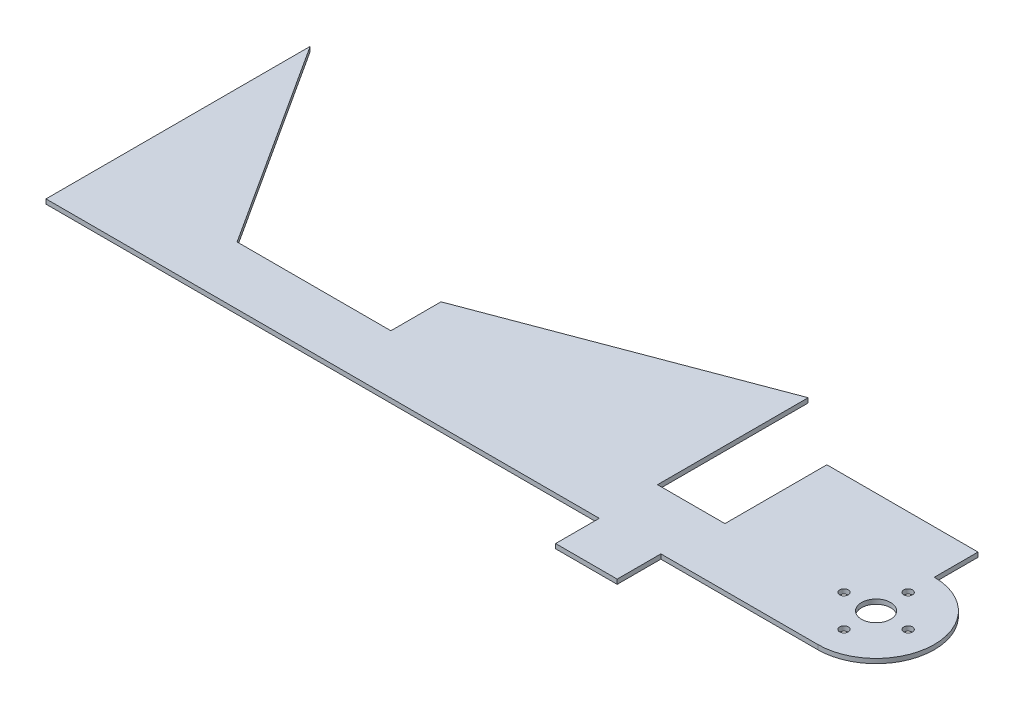
ISO-10303-21;
HEADER;
FILE_DESCRIPTION(('STEP AP214'),'2;1');
FILE_NAME('part.step','',(''),(''),'','','');
FILE_SCHEMA(('AUTOMOTIVE_DESIGN { 1 0 10303 214 1 1 1 1 }'));
ENDSEC;
DATA;
#1=APPLICATION_CONTEXT('core data for automotive mechanical design processes');
#2=APPLICATION_PROTOCOL_DEFINITION('international standard','automotive_design',2000,#1);
#3=PRODUCT_CONTEXT('',#1,'mechanical');
#4=PRODUCT('Part','Part','',(#3));
#5=PRODUCT_RELATED_PRODUCT_CATEGORY('part','',(#4));
#6=PRODUCT_DEFINITION_FORMATION('','',#4);
#7=PRODUCT_DEFINITION_CONTEXT('part definition',#1,'design');
#8=PRODUCT_DEFINITION('design','',#6,#7);
#9=PRODUCT_DEFINITION_SHAPE('','',#8);
#10=(LENGTH_UNIT() NAMED_UNIT(*) SI_UNIT(.MILLI.,.METRE.));
#11=(NAMED_UNIT(*) PLANE_ANGLE_UNIT() SI_UNIT($,.RADIAN.));
#12=(NAMED_UNIT(*) SI_UNIT($,.STERADIAN.) SOLID_ANGLE_UNIT());
#13=UNCERTAINTY_MEASURE_WITH_UNIT(LENGTH_MEASURE(1.E-05),#10,'distance_accuracy_value','');
#14=(GEOMETRIC_REPRESENTATION_CONTEXT(3) GLOBAL_UNCERTAINTY_ASSIGNED_CONTEXT((#13)) GLOBAL_UNIT_ASSIGNED_CONTEXT((#10,
#11,#12)) REPRESENTATION_CONTEXT('',''));
#15=CARTESIAN_POINT('',(0.,0.,0.));
#16=DIRECTION('',(0.,0.,1.));
#17=DIRECTION('',(1.,0.,0.));
#18=AXIS2_PLACEMENT_3D('',#15,#16,#17);
#19=CARTESIAN_POINT('',(0.,1.000000032,47.7604589923772));
#20=DIRECTION('',(0.,0.,-1.));
#21=DIRECTION('',(-1.,0.,0.));
#22=AXIS2_PLACEMENT_3D('',#19,#20,#21);
#23=PLANE('',#22);
#24=DIRECTION('',(0.,1.,0.));
#25=VECTOR('',#24,1.);
#26=CARTESIAN_POINT('',(73.7550000640245,0.,47.7604589923772));
#27=LINE('',#26,#25);
#28=CARTESIAN_POINT('',(73.7550000640245,0.,47.7604589923772));
#29=VERTEX_POINT('',#28);
#30=CARTESIAN_POINT('',(73.7550000640245,1.000000032,47.7604589923772));
#31=VERTEX_POINT('',#30);
#32=EDGE_CURVE('E225',#29,#31,#27,.T.);
#33=ORIENTED_EDGE('',*,*,#32,.F.);
#34=DIRECTION('',(1.,0.,0.));
#35=VECTOR('',#34,1.);
#36=CARTESIAN_POINT('',(0.,0.,47.7604589923772));
#37=LINE('',#36,#35);
#38=CARTESIAN_POINT('',(107.985056064,0.,47.7604589923772));
#39=VERTEX_POINT('',#38);
#40=EDGE_CURVE('E265',#29,#39,#37,.T.);
#41=ORIENTED_EDGE('',*,*,#40,.T.);
#42=DIRECTION('',(0.,-1.,0.));
#43=VECTOR('',#42,1.);
#44=CARTESIAN_POINT('',(107.985056064,1.000000032,47.7604589923772));
#45=LINE('',#44,#43);
#46=CARTESIAN_POINT('',(107.985056064,1.000000032,47.7604589923772));
#47=VERTEX_POINT('',#46);
#48=EDGE_CURVE('E172',#47,#39,#45,.T.);
#49=ORIENTED_EDGE('',*,*,#48,.F.);
#50=DIRECTION('',(1.,0.,0.));
#51=VECTOR('',#50,1.);
#52=CARTESIAN_POINT('',(-60.325,1.000000032,47.7604589923772));
#53=LINE('',#52,#51);
#54=EDGE_CURVE('E71',#31,#47,#53,.T.);
#55=ORIENTED_EDGE('',*,*,#54,.F.);
#56=EDGE_LOOP('',(#33,#41,#49,#55));
#57=FACE_BOUND('',#56,.T.);
#58=ADVANCED_FACE('F48',(#57),#23,.F.);
#59=CARTESIAN_POINT('',(-26.791523135015,1.000000032,35.0604589923772));
#60=DIRECTION('',(0.,0.,1.));
#61=DIRECTION('',(1.,0.,0.));
#62=AXIS2_PLACEMENT_3D('',#59,#60,#61);
#63=PLANE('',#62);
#64=DIRECTION('',(-1.,0.,0.));
#65=VECTOR('',#64,1.);
#66=CARTESIAN_POINT('',(-26.791523135015,0.,35.0604589923772));
#67=LINE('',#66,#65);
#68=CARTESIAN_POINT('',(2.18198568951236,0.,35.0604589923772));
#69=VERTEX_POINT('',#68);
#70=CARTESIAN_POINT('',(-31.3514911754726,0.,35.0604589923772));
#71=VERTEX_POINT('',#70);
#72=EDGE_CURVE('E162',#69,#71,#67,.T.);
#73=ORIENTED_EDGE('',*,*,#72,.T.);
#74=DIRECTION('',(0.,-1.,0.));
#75=VECTOR('',#74,1.);
#76=CARTESIAN_POINT('',(-31.3514911754726,1.000000032,35.0604589923772));
#77=LINE('',#76,#75);
#78=CARTESIAN_POINT('',(-31.3514911754726,1.000000032,35.0604589923772));
#79=VERTEX_POINT('',#78);
#80=EDGE_CURVE('E12',#79,#71,#77,.T.);
#81=ORIENTED_EDGE('',*,*,#80,.F.);
#82=DIRECTION('',(-1.,0.,0.));
#83=VECTOR('',#82,1.);
#84=CARTESIAN_POINT('',(-26.791523135015,1.000000032,35.0604589923772));
#85=LINE('',#84,#83);
#86=CARTESIAN_POINT('',(2.18198568951236,1.000000032,35.0604589923772));
#87=VERTEX_POINT('',#86);
#88=EDGE_CURVE('E177',#87,#79,#85,.T.);
#89=ORIENTED_EDGE('',*,*,#88,.F.);
#90=DIRECTION('',(0.,1.,0.));
#91=VECTOR('',#90,1.);
#92=CARTESIAN_POINT('',(2.18198568951236,0.,35.0604589923772));
#93=LINE('',#92,#91);
#94=EDGE_CURVE('E175',#69,#87,#93,.T.);
#95=ORIENTED_EDGE('',*,*,#94,.F.);
#96=EDGE_LOOP('',(#73,#81,#89,#95));
#97=FACE_BOUND('',#96,.T.);
#98=ADVANCED_FACE('F50',(#97),#63,.F.);
#99=CARTESIAN_POINT('',(-31.3514911754726,1.000000032,35.0604589923772));
#100=DIRECTION('',(-0.840254527131316,0.,0.542192151949222));
#101=DIRECTION('',(0.542192151949222,0.,0.840254527131316));
#102=AXIS2_PLACEMENT_3D('',#99,#100,#101);
#103=PLANE('',#102);
#104=DIRECTION('',(-0.542192151949222,0.,-0.840254527131316));
#105=VECTOR('',#104,1.);
#106=CARTESIAN_POINT('',(-31.3514911754726,0.,35.0604589923772));
#107=LINE('',#106,#105);
#108=CARTESIAN_POINT('',(-60.325,0.,-9.8408216129686));
#109=VERTEX_POINT('',#108);
#110=EDGE_CURVE('E169',#71,#109,#107,.T.);
#111=ORIENTED_EDGE('',*,*,#110,.T.);
#112=DIRECTION('',(0.,-1.,0.));
#113=VECTOR('',#112,1.);
#114=CARTESIAN_POINT('',(-60.325,1.000000032,-9.8408216129686));
#115=LINE('',#114,#113);
#116=CARTESIAN_POINT('',(-60.325,1.000000032,-9.8408216129686));
#117=VERTEX_POINT('',#116);
#118=EDGE_CURVE('E56',#117,#109,#115,.T.);
#119=ORIENTED_EDGE('',*,*,#118,.F.);
#120=DIRECTION('',(-0.542192151949222,0.,-0.840254527131316));
#121=VECTOR('',#120,1.);
#122=CARTESIAN_POINT('',(-31.3514911754726,1.000000032,35.0604589923772));
#123=LINE('',#122,#121);
#124=EDGE_CURVE('E194',#79,#117,#123,.T.);
#125=ORIENTED_EDGE('',*,*,#124,.F.);
#126=ORIENTED_EDGE('',*,*,#80,.T.);
#127=EDGE_LOOP('',(#111,#119,#125,#126));
#128=FACE_BOUND('',#127,.T.);
#129=ADVANCED_FACE('F379',(#128),#103,.F.);
#130=CARTESIAN_POINT('',(-60.325,1.000000032,-9.8408216129686));
#131=DIRECTION('',(1.,0.,0.));
#132=DIRECTION('',(0.,0.,-1.));
#133=AXIS2_PLACEMENT_3D('',#130,#131,#132);
#134=PLANE('',#133);
#135=DIRECTION('',(0.,0.,1.));
#136=VECTOR('',#135,1.);
#137=CARTESIAN_POINT('',(-60.325,0.,-9.8408216129686));
#138=LINE('',#137,#136);
#139=CARTESIAN_POINT('',(-60.325,0.,47.7604589923772));
#140=VERTEX_POINT('',#139);
#141=EDGE_CURVE('E262',#109,#140,#138,.T.);
#142=ORIENTED_EDGE('',*,*,#141,.T.);
#143=DIRECTION('',(0.,-1.,0.));
#144=VECTOR('',#143,1.);
#145=CARTESIAN_POINT('',(-60.325,1.000000032,47.7604589923772));
#146=LINE('',#145,#144);
#147=CARTESIAN_POINT('',(-60.325,1.000000032,47.7604589923772));
#148=VERTEX_POINT('',#147);
#149=EDGE_CURVE('E273',#148,#140,#146,.T.);
#150=ORIENTED_EDGE('',*,*,#149,.F.);
#151=DIRECTION('',(0.,0.,1.));
#152=VECTOR('',#151,1.);
#153=CARTESIAN_POINT('',(-60.325,1.000000032,-9.8408216129686));
#154=LINE('',#153,#152);
#155=EDGE_CURVE('E199',#117,#148,#154,.T.);
#156=ORIENTED_EDGE('',*,*,#155,.F.);
#157=ORIENTED_EDGE('',*,*,#118,.T.);
#158=EDGE_LOOP('',(#142,#150,#156,#157));
#159=FACE_BOUND('',#158,.T.);
#160=ADVANCED_FACE('F279',(#159),#134,.F.);
#161=CARTESIAN_POINT('',(60.325,0.,47.7604589923772));
#162=VERTEX_POINT('',#161);
#163=EDGE_CURVE('E266',#140,#162,#37,.T.);
#164=ORIENTED_EDGE('',*,*,#163,.T.);
#165=DIRECTION('',(0.,1.,0.));
#166=VECTOR('',#165,1.);
#167=CARTESIAN_POINT('',(60.325,0.,47.7604589923772));
#168=LINE('',#167,#166);
#169=CARTESIAN_POINT('',(60.325,1.000000032,47.7604589923772));
#170=VERTEX_POINT('',#169);
#171=EDGE_CURVE('E288',#162,#170,#168,.T.);
#172=ORIENTED_EDGE('',*,*,#171,.T.);
#173=EDGE_CURVE('E202',#148,#170,#53,.T.);
#174=ORIENTED_EDGE('',*,*,#173,.F.);
#175=ORIENTED_EDGE('',*,*,#149,.T.);
#176=EDGE_LOOP('',(#164,#172,#174,#175));
#177=FACE_BOUND('',#176,.T.);
#178=ADVANCED_FACE('F286',(#177),#23,.F.);
#179=CARTESIAN_POINT('',(60.325,1.000000032,47.7604589923772));
#180=DIRECTION('',(-1.,0.,0.));
#181=DIRECTION('',(0.,0.,1.));
#182=AXIS2_PLACEMENT_3D('',#179,#180,#181);
#183=PLANE('',#182);
#184=DIRECTION('',(0.,0.,-1.));
#185=VECTOR('',#184,1.);
#186=CARTESIAN_POINT('',(60.325,1.000000032,47.7604589923772));
#187=LINE('',#186,#185);
#188=CARTESIAN_POINT('',(60.325,1.000000032,35.0604589923772));
#189=VERTEX_POINT('',#188);
#190=CARTESIAN_POINT('',(60.325,1.000000032,2.20095588529345));
#191=VERTEX_POINT('',#190);
#192=EDGE_CURVE('E254',#189,#191,#187,.T.);
#193=ORIENTED_EDGE('',*,*,#192,.F.);
#194=DIRECTION('',(0.,-1.,0.));
#195=VECTOR('',#194,1.);
#196=CARTESIAN_POINT('',(60.325,1.000000032,35.0604589923772));
#197=LINE('',#196,#195);
#198=CARTESIAN_POINT('',(60.325,0.,35.0604589923772));
#199=VERTEX_POINT('',#198);
#200=EDGE_CURVE('E400',#189,#199,#197,.T.);
#201=ORIENTED_EDGE('',*,*,#200,.T.);
#202=DIRECTION('',(0.,0.,-1.));
#203=VECTOR('',#202,1.);
#204=CARTESIAN_POINT('',(60.325,0.,47.7604589923772));
#205=LINE('',#204,#203);
#206=CARTESIAN_POINT('',(60.325,0.,2.20095588529345));
#207=VERTEX_POINT('',#206);
#208=EDGE_CURVE('E268',#199,#207,#205,.T.);
#209=ORIENTED_EDGE('',*,*,#208,.T.);
#210=DIRECTION('',(0.,-1.,0.));
#211=VECTOR('',#210,1.);
#212=CARTESIAN_POINT('',(60.325,1.000000032,2.20095588529345));
#213=LINE('',#212,#211);
#214=EDGE_CURVE('E259',#191,#207,#213,.T.);
#215=ORIENTED_EDGE('',*,*,#214,.F.);
#216=EDGE_LOOP('',(#193,#201,#209,#215));
#217=FACE_BOUND('',#216,.T.);
#218=ADVANCED_FACE('F367',(#217),#183,.F.);
#219=CARTESIAN_POINT('',(60.325,1.000000032,2.20095588529345));
#220=DIRECTION('',(0.35291945506022,0.,0.935653706367905));
#221=DIRECTION('',(0.935653706367905,0.,-0.35291945506022));
#222=AXIS2_PLACEMENT_3D('',#219,#220,#221);
#223=PLANE('',#222);
#224=DIRECTION('',(-0.935653706367905,0.,0.35291945506022));
#225=VECTOR('',#224,1.);
#226=CARTESIAN_POINT('',(60.325,0.,2.20095588529345));
#227=LINE('',#226,#225);
#228=CARTESIAN_POINT('',(2.18198568951236,0.,24.1319339665659));
#229=VERTEX_POINT('',#228);
#230=EDGE_CURVE('E195',#207,#229,#227,.T.);
#231=ORIENTED_EDGE('',*,*,#230,.T.);
#232=DIRECTION('',(0.,1.,0.));
#233=VECTOR('',#232,1.);
#234=CARTESIAN_POINT('',(2.18198568951236,0.,24.1319339665659));
#235=LINE('',#234,#233);
#236=CARTESIAN_POINT('',(2.18198568951236,1.000000032,24.1319339665659));
#237=VERTEX_POINT('',#236);
#238=EDGE_CURVE('E63',#229,#237,#235,.T.);
#239=ORIENTED_EDGE('',*,*,#238,.T.);
#240=DIRECTION('',(-0.935653706367905,0.,0.35291945506022));
#241=VECTOR('',#240,1.);
#242=CARTESIAN_POINT('',(60.325,1.000000032,2.20095588529345));
#243=LINE('',#242,#241);
#244=EDGE_CURVE('E256',#191,#237,#243,.T.);
#245=ORIENTED_EDGE('',*,*,#244,.F.);
#246=ORIENTED_EDGE('',*,*,#214,.T.);
#247=EDGE_LOOP('',(#231,#239,#245,#246));
#248=FACE_BOUND('',#247,.T.);
#249=ADVANCED_FACE('F357',(#248),#223,.F.);
#250=CARTESIAN_POINT('',(0.,1.000000032,0.));
#251=DIRECTION('',(0.,1.,0.));
#252=DIRECTION('',(0.,0.,1.));
#253=AXIS2_PLACEMENT_3D('',#250,#251,#252);
#254=PLANE('',#253);
#255=DIRECTION('',(0.,0.,-1.));
#256=VECTOR('',#255,1.);
#257=CARTESIAN_POINT('',(2.18198568951236,1.000000032,24.1319339665659));
#258=LINE('',#257,#256);
#259=EDGE_CURVE('E181',#87,#237,#258,.T.);
#260=ORIENTED_EDGE('',*,*,#259,.F.);
#261=ORIENTED_EDGE('',*,*,#88,.T.);
#262=ORIENTED_EDGE('',*,*,#124,.T.);
#263=ORIENTED_EDGE('',*,*,#155,.T.);
#264=ORIENTED_EDGE('',*,*,#173,.T.);
#265=DIRECTION('',(0.,0.,1.));
#266=VECTOR('',#265,1.);
#267=CARTESIAN_POINT('',(60.325,1.000000032,0.));
#268=LINE('',#267,#266);
#269=CARTESIAN_POINT('',(60.325,1.000000032,57.2854589923772));
#270=VERTEX_POINT('',#269);
#271=EDGE_CURVE('E211',#170,#270,#268,.T.);
#272=ORIENTED_EDGE('',*,*,#271,.T.);
#273=DIRECTION('',(-1.,0.,0.));
#274=VECTOR('',#273,1.);
#275=CARTESIAN_POINT('',(0.,1.000000032,57.2854589923772));
#276=LINE('',#275,#274);
#277=CARTESIAN_POINT('',(73.7550000640245,1.000000032,57.2854589923772));
#278=VERTEX_POINT('',#277);
#279=EDGE_CURVE('E215',#278,#270,#276,.T.);
#280=ORIENTED_EDGE('',*,*,#279,.F.);
#281=DIRECTION('',(0.,0.,1.));
#282=VECTOR('',#281,1.);
#283=CARTESIAN_POINT('',(73.7550000640245,1.000000032,0.));
#284=LINE('',#283,#282);
#285=EDGE_CURVE('E221',#31,#278,#284,.T.);
#286=ORIENTED_EDGE('',*,*,#285,.F.);
#287=ORIENTED_EDGE('',*,*,#54,.T.);
#288=CARTESIAN_POINT('',(107.985056064,1.000000032,35.0604589923772));
#289=DIRECTION('',(0.,1.,0.));
#290=DIRECTION('',(0.,0.,1.));
#291=AXIS2_PLACEMENT_3D('',#288,#289,#290);
#292=CIRCLE('',#291,12.7);
#293=CARTESIAN_POINT('',(107.985056064,1.000000032,22.3604589923772));
#294=VERTEX_POINT('',#293);
#295=EDGE_CURVE('E233',#47,#294,#292,.T.);
#296=ORIENTED_EDGE('',*,*,#295,.T.);
#297=DIRECTION('',(0.,0.,-1.));
#298=VECTOR('',#297,1.);
#299=CARTESIAN_POINT('',(107.985056064,1.000000032,0.));
#300=LINE('',#299,#298);
#301=CARTESIAN_POINT('',(107.985056064,1.000000032,12.8354589923772));
#302=VERTEX_POINT('',#301);
#303=EDGE_CURVE('E305',#294,#302,#300,.T.);
#304=ORIENTED_EDGE('',*,*,#303,.T.);
#305=DIRECTION('',(1.,0.,0.));
#306=VECTOR('',#305,1.);
#307=CARTESIAN_POINT('',(0.,1.000000032,12.8354589923772));
#308=LINE('',#307,#306);
#309=CARTESIAN_POINT('',(75.0250000640245,1.000000032,12.8354589923772));
#310=VERTEX_POINT('',#309);
#311=EDGE_CURVE('E303',#310,#302,#308,.T.);
#312=ORIENTED_EDGE('',*,*,#311,.F.);
#313=DIRECTION('',(0.,0.,1.));
#314=VECTOR('',#313,1.);
#315=CARTESIAN_POINT('',(75.025000064,1.000000032,22.3604589923772));
#316=LINE('',#315,#314);
#317=CARTESIAN_POINT('',(75.025000064,1.000000032,35.0604589923772));
#318=VERTEX_POINT('',#317);
#319=EDGE_CURVE('E237',#310,#318,#316,.T.);
#320=ORIENTED_EDGE('',*,*,#319,.T.);
#321=DIRECTION('',(-1.,0.,0.));
#322=VECTOR('',#321,1.);
#323=CARTESIAN_POINT('',(60.325,1.000000032,35.0604589923772));
#324=LINE('',#323,#322);
#325=EDGE_CURVE('E244',#318,#189,#324,.T.);
#326=ORIENTED_EDGE('',*,*,#325,.T.);
#327=ORIENTED_EDGE('',*,*,#192,.T.);
#328=ORIENTED_EDGE('',*,*,#244,.T.);
#329=EDGE_LOOP('',(#260,#261,#262,#263,#264,#272,#280,#286,#287,#296,#304,#312,#320,#326,#327,#328));
#330=FACE_BOUND('',#329,.T.);
#331=CARTESIAN_POINT('',(107.985056064,1.000000032,42.0604589623772));
#332=DIRECTION('',(0.,1.,0.));
#333=DIRECTION('',(0.,0.,1.));
#334=AXIS2_PLACEMENT_3D('',#331,#332,#333);
#335=CIRCLE('',#334,0.950000005000015);
#336=CARTESIAN_POINT('',(107.985056064,1.000000032,43.0104589673772));
#337=VERTEX_POINT('',#336);
#338=EDGE_CURVE('E332',#337,#337,#335,.T.);
#339=ORIENTED_EDGE('',*,*,#338,.F.);
#340=EDGE_LOOP('',(#339));
#341=FACE_BOUND('',#340,.T.);
#342=CARTESIAN_POINT('',(107.985056064,1.000000032,28.0604590223772));
#343=DIRECTION('',(0.,1.,0.));
#344=DIRECTION('',(0.,0.,1.));
#345=AXIS2_PLACEMENT_3D('',#342,#343,#344);
#346=CIRCLE('',#345,0.950000005000014);
#347=CARTESIAN_POINT('',(107.985056064,1.000000032,29.0104590273772));
#348=VERTEX_POINT('',#347);
#349=EDGE_CURVE('E338',#348,#348,#346,.T.);
#350=ORIENTED_EDGE('',*,*,#349,.F.);
#351=EDGE_LOOP('',(#350));
#352=FACE_BOUND('',#351,.T.);
#353=CARTESIAN_POINT('',(100.985056094,1.000000032,35.0604589923772));
#354=DIRECTION('',(0.,1.,0.));
#355=DIRECTION('',(0.,0.,1.));
#356=AXIS2_PLACEMENT_3D('',#353,#354,#355);
#357=CIRCLE('',#356,0.950000005000013);
#358=CARTESIAN_POINT('',(100.985056094,1.000000032,36.0104589973772));
#359=VERTEX_POINT('',#358);
#360=EDGE_CURVE('E316',#359,#359,#357,.T.);
#361=ORIENTED_EDGE('',*,*,#360,.F.);
#362=EDGE_LOOP('',(#361));
#363=FACE_BOUND('',#362,.T.);
#364=CARTESIAN_POINT('',(114.985056034,1.000000032,35.0604589923772));
#365=DIRECTION('',(0.,1.,0.));
#366=DIRECTION('',(0.,0.,1.));
#367=AXIS2_PLACEMENT_3D('',#364,#365,#366);
#368=CIRCLE('',#367,0.950000005000013);
#369=CARTESIAN_POINT('',(114.985056034,1.000000032,36.0104589973772));
#370=VERTEX_POINT('',#369);
#371=EDGE_CURVE('E326',#370,#370,#368,.T.);
#372=ORIENTED_EDGE('',*,*,#371,.F.);
#373=EDGE_LOOP('',(#372));
#374=FACE_BOUND('',#373,.T.);
#375=CARTESIAN_POINT('',(107.985056064,1.000000032,35.0604589923772));
#376=DIRECTION('',(0.,1.,0.));
#377=DIRECTION('',(0.,0.,1.));
#378=AXIS2_PLACEMENT_3D('',#375,#376,#377);
#379=CIRCLE('',#378,3.175);
#380=CARTESIAN_POINT('',(107.985056064,1.000000032,38.2354589923772));
#381=VERTEX_POINT('',#380);
#382=EDGE_CURVE('E239',#381,#381,#379,.T.);
#383=ORIENTED_EDGE('',*,*,#382,.F.);
#384=EDGE_LOOP('',(#383));
#385=FACE_BOUND('',#384,.T.);
#386=ADVANCED_FACE('F355',(#330,#341,#352,#363,#374,#385),#254,.T.);
#387=CARTESIAN_POINT('',(0.,0.,0.));
#388=DIRECTION('',(0.,1.,0.));
#389=DIRECTION('',(0.,0.,1.));
#390=AXIS2_PLACEMENT_3D('',#387,#388,#389);
#391=PLANE('',#390);
#392=CARTESIAN_POINT('',(107.985056064,0.,42.0604589623772));
#393=DIRECTION('',(0.,1.,0.));
#394=DIRECTION('',(0.,0.,1.));
#395=AXIS2_PLACEMENT_3D('',#392,#393,#394);
#396=CIRCLE('',#395,0.950000005000015);
#397=CARTESIAN_POINT('',(107.985056064,0.,43.0104589673772));
#398=VERTEX_POINT('',#397);
#399=EDGE_CURVE('E336',#398,#398,#396,.T.);
#400=ORIENTED_EDGE('',*,*,#399,.T.);
#401=EDGE_LOOP('',(#400));
#402=FACE_BOUND('',#401,.T.);
#403=CARTESIAN_POINT('',(107.985056064,0.,28.0604590223772));
#404=DIRECTION('',(0.,1.,0.));
#405=DIRECTION('',(0.,0.,1.));
#406=AXIS2_PLACEMENT_3D('',#403,#404,#405);
#407=CIRCLE('',#406,0.950000005000014);
#408=CARTESIAN_POINT('',(107.985056064,0.,29.0104590273772));
#409=VERTEX_POINT('',#408);
#410=EDGE_CURVE('E320',#409,#409,#407,.T.);
#411=ORIENTED_EDGE('',*,*,#410,.T.);
#412=EDGE_LOOP('',(#411));
#413=FACE_BOUND('',#412,.T.);
#414=CARTESIAN_POINT('',(100.985056094,0.,35.0604589923772));
#415=DIRECTION('',(0.,1.,0.));
#416=DIRECTION('',(0.,0.,1.));
#417=AXIS2_PLACEMENT_3D('',#414,#415,#416);
#418=CIRCLE('',#417,0.950000005000013);
#419=CARTESIAN_POINT('',(100.985056094,0.,36.0104589973772));
#420=VERTEX_POINT('',#419);
#421=EDGE_CURVE('E321',#420,#420,#418,.T.);
#422=ORIENTED_EDGE('',*,*,#421,.T.);
#423=EDGE_LOOP('',(#422));
#424=FACE_BOUND('',#423,.T.);
#425=CARTESIAN_POINT('',(114.985056034,0.,35.0604589923772));
#426=DIRECTION('',(0.,1.,0.));
#427=DIRECTION('',(0.,0.,1.));
#428=AXIS2_PLACEMENT_3D('',#425,#426,#427);
#429=CIRCLE('',#428,0.950000005000013);
#430=CARTESIAN_POINT('',(114.985056034,0.,36.0104589973772));
#431=VERTEX_POINT('',#430);
#432=EDGE_CURVE('E314',#431,#431,#429,.T.);
#433=ORIENTED_EDGE('',*,*,#432,.T.);
#434=EDGE_LOOP('',(#433));
#435=FACE_BOUND('',#434,.T.);
#436=CARTESIAN_POINT('',(107.985056064,0.,35.0604589923772));
#437=DIRECTION('',(0.,1.,0.));
#438=DIRECTION('',(0.,0.,1.));
#439=AXIS2_PLACEMENT_3D('',#436,#437,#438);
#440=CIRCLE('',#439,3.175);
#441=CARTESIAN_POINT('',(107.985056064,0.,38.2354589923772));
#442=VERTEX_POINT('',#441);
#443=EDGE_CURVE('E343',#442,#442,#440,.T.);
#444=ORIENTED_EDGE('',*,*,#443,.T.);
#445=EDGE_LOOP('',(#444));
#446=FACE_BOUND('',#445,.T.);
#447=ORIENTED_EDGE('',*,*,#72,.F.);
#448=DIRECTION('',(0.,0.,-1.));
#449=VECTOR('',#448,1.);
#450=CARTESIAN_POINT('',(2.18198568951236,0.,24.1319339665659));
#451=LINE('',#450,#449);
#452=EDGE_CURVE('E166',#69,#229,#451,.T.);
#453=ORIENTED_EDGE('',*,*,#452,.T.);
#454=ORIENTED_EDGE('',*,*,#230,.F.);
#455=ORIENTED_EDGE('',*,*,#208,.F.);
#456=DIRECTION('',(-1.,0.,0.));
#457=VECTOR('',#456,1.);
#458=CARTESIAN_POINT('',(60.325,0.,35.0604589923772));
#459=LINE('',#458,#457);
#460=CARTESIAN_POINT('',(75.025000064,0.,35.0604589923772));
#461=VERTEX_POINT('',#460);
#462=EDGE_CURVE('E238',#461,#199,#459,.T.);
#463=ORIENTED_EDGE('',*,*,#462,.F.);
#464=DIRECTION('',(0.,0.,1.));
#465=VECTOR('',#464,1.);
#466=CARTESIAN_POINT('',(75.025000064,0.,22.3604589923772));
#467=LINE('',#466,#465);
#468=CARTESIAN_POINT('',(75.0250000640245,0.,12.8354589923772));
#469=VERTEX_POINT('',#468);
#470=EDGE_CURVE('E349',#469,#461,#467,.T.);
#471=ORIENTED_EDGE('',*,*,#470,.F.);
#472=DIRECTION('',(1.,0.,0.));
#473=VECTOR('',#472,1.);
#474=CARTESIAN_POINT('',(0.,0.,12.8354589923772));
#475=LINE('',#474,#473);
#476=CARTESIAN_POINT('',(107.985056064,0.,12.8354589923772));
#477=VERTEX_POINT('',#476);
#478=EDGE_CURVE('E302',#469,#477,#475,.T.);
#479=ORIENTED_EDGE('',*,*,#478,.T.);
#480=DIRECTION('',(0.,0.,-1.));
#481=VECTOR('',#480,1.);
#482=CARTESIAN_POINT('',(107.985056064,0.,0.));
#483=LINE('',#482,#481);
#484=CARTESIAN_POINT('',(107.985056064,0.,22.3604589923772));
#485=VERTEX_POINT('',#484);
#486=EDGE_CURVE('E299',#485,#477,#483,.T.);
#487=ORIENTED_EDGE('',*,*,#486,.F.);
#488=CARTESIAN_POINT('',(107.985056064,0.,35.0604589923772));
#489=DIRECTION('',(0.,1.,0.));
#490=DIRECTION('',(0.,0.,1.));
#491=AXIS2_PLACEMENT_3D('',#488,#489,#490);
#492=CIRCLE('',#491,12.7);
#493=EDGE_CURVE('E345',#39,#485,#492,.T.);
#494=ORIENTED_EDGE('',*,*,#493,.F.);
#495=ORIENTED_EDGE('',*,*,#40,.F.);
#496=DIRECTION('',(0.,0.,1.));
#497=VECTOR('',#496,1.);
#498=CARTESIAN_POINT('',(73.7550000640245,0.,0.));
#499=LINE('',#498,#497);
#500=CARTESIAN_POINT('',(73.7550000640245,0.,57.2854589923772));
#501=VERTEX_POINT('',#500);
#502=EDGE_CURVE('E216',#29,#501,#499,.T.);
#503=ORIENTED_EDGE('',*,*,#502,.T.);
#504=DIRECTION('',(-1.,0.,0.));
#505=VECTOR('',#504,1.);
#506=CARTESIAN_POINT('',(0.,0.,57.2854589923772));
#507=LINE('',#506,#505);
#508=CARTESIAN_POINT('',(60.325,0.,57.2854589923772));
#509=VERTEX_POINT('',#508);
#510=EDGE_CURVE('E297',#501,#509,#507,.T.);
#511=ORIENTED_EDGE('',*,*,#510,.T.);
#512=DIRECTION('',(0.,0.,1.));
#513=VECTOR('',#512,1.);
#514=CARTESIAN_POINT('',(60.325,0.,0.));
#515=LINE('',#514,#513);
#516=EDGE_CURVE('E224',#162,#509,#515,.T.);
#517=ORIENTED_EDGE('',*,*,#516,.F.);
#518=ORIENTED_EDGE('',*,*,#163,.F.);
#519=ORIENTED_EDGE('',*,*,#141,.F.);
#520=ORIENTED_EDGE('',*,*,#110,.F.);
#521=EDGE_LOOP('',(#447,#453,#454,#455,#463,#471,#479,#487,#494,#495,#503,#511,#517,#518,#519,#520));
#522=FACE_BOUND('',#521,.T.);
#523=ADVANCED_FACE('F164',(#402,#413,#424,#435,#446,#522),#391,.F.);
#524=CARTESIAN_POINT('',(107.985056064,1.000000032,35.0604589923772));
#525=DIRECTION('',(0.,-1.,0.));
#526=DIRECTION('',(0.,0.,-1.));
#527=AXIS2_PLACEMENT_3D('',#524,#525,#526);
#528=CYLINDRICAL_SURFACE('',#527,12.7);
#529=ORIENTED_EDGE('',*,*,#493,.T.);
#530=DIRECTION('',(0.,-1.,0.));
#531=VECTOR('',#530,1.);
#532=CARTESIAN_POINT('',(107.985056064,1.000000032,22.3604589923772));
#533=LINE('',#532,#531);
#534=EDGE_CURVE('E406',#294,#485,#533,.T.);
#535=ORIENTED_EDGE('',*,*,#534,.F.);
#536=ORIENTED_EDGE('',*,*,#295,.F.);
#537=ORIENTED_EDGE('',*,*,#48,.T.);
#538=EDGE_LOOP('',(#529,#535,#536,#537));
#539=FACE_BOUND('',#538,.T.);
#540=ADVANCED_FACE('F364',(#539),#528,.T.);
#541=CARTESIAN_POINT('',(75.025000064,1.000000032,22.3604589923772));
#542=DIRECTION('',(1.,0.,0.));
#543=DIRECTION('',(0.,0.,-1.));
#544=AXIS2_PLACEMENT_3D('',#541,#542,#543);
#545=PLANE('',#544);
#546=ORIENTED_EDGE('',*,*,#470,.T.);
#547=DIRECTION('',(0.,-1.,0.));
#548=VECTOR('',#547,1.);
#549=CARTESIAN_POINT('',(75.025000064,1.000000032,35.0604589923772));
#550=LINE('',#549,#548);
#551=EDGE_CURVE('E403',#318,#461,#550,.T.);
#552=ORIENTED_EDGE('',*,*,#551,.F.);
#553=ORIENTED_EDGE('',*,*,#319,.F.);
#554=DIRECTION('',(0.,1.,0.));
#555=VECTOR('',#554,1.);
#556=CARTESIAN_POINT('',(75.0250000640245,0.,12.8354589923772));
#557=LINE('',#556,#555);
#558=EDGE_CURVE('E311',#469,#310,#557,.T.);
#559=ORIENTED_EDGE('',*,*,#558,.F.);
#560=EDGE_LOOP('',(#546,#552,#553,#559));
#561=FACE_BOUND('',#560,.T.);
#562=ADVANCED_FACE('F471',(#561),#545,.F.);
#563=CARTESIAN_POINT('',(60.325,1.000000032,35.0604589923772));
#564=DIRECTION('',(0.,0.,1.));
#565=DIRECTION('',(1.,0.,0.));
#566=AXIS2_PLACEMENT_3D('',#563,#564,#565);
#567=PLANE('',#566);
#568=ORIENTED_EDGE('',*,*,#462,.T.);
#569=ORIENTED_EDGE('',*,*,#200,.F.);
#570=ORIENTED_EDGE('',*,*,#325,.F.);
#571=ORIENTED_EDGE('',*,*,#551,.T.);
#572=EDGE_LOOP('',(#568,#569,#570,#571));
#573=FACE_BOUND('',#572,.T.);
#574=ADVANCED_FACE('F467',(#573),#567,.F.);
#575=CARTESIAN_POINT('',(107.985056064,0.,35.0604589923772));
#576=DIRECTION('',(0.,1.,0.));
#577=DIRECTION('',(0.,0.,1.));
#578=AXIS2_PLACEMENT_3D('',#575,#576,#577);
#579=CYLINDRICAL_SURFACE('',#578,3.175);
#580=ORIENTED_EDGE('',*,*,#443,.F.);
#581=EDGE_LOOP('',(#580));
#582=FACE_BOUND('',#581,.T.);
#583=ORIENTED_EDGE('',*,*,#382,.T.);
#584=EDGE_LOOP('',(#583));
#585=FACE_BOUND('',#584,.T.);
#586=ADVANCED_FACE('F353',(#582,#585),#579,.F.);
#587=CARTESIAN_POINT('',(114.985056034,0.,35.0604589923772));
#588=DIRECTION('',(0.,1.,0.));
#589=DIRECTION('',(0.,0.,1.));
#590=AXIS2_PLACEMENT_3D('',#587,#588,#589);
#591=CYLINDRICAL_SURFACE('',#590,0.950000005000013);
#592=ORIENTED_EDGE('',*,*,#432,.F.);
#593=EDGE_LOOP('',(#592));
#594=FACE_BOUND('',#593,.T.);
#595=ORIENTED_EDGE('',*,*,#371,.T.);
#596=EDGE_LOOP('',(#595));
#597=FACE_BOUND('',#596,.T.);
#598=ADVANCED_FACE('F455',(#594,#597),#591,.F.);
#599=CARTESIAN_POINT('',(100.985056094,0.,35.0604589923772));
#600=DIRECTION('',(0.,1.,0.));
#601=DIRECTION('',(0.,0.,1.));
#602=AXIS2_PLACEMENT_3D('',#599,#600,#601);
#603=CYLINDRICAL_SURFACE('',#602,0.950000005000013);
#604=ORIENTED_EDGE('',*,*,#421,.F.);
#605=EDGE_LOOP('',(#604));
#606=FACE_BOUND('',#605,.T.);
#607=ORIENTED_EDGE('',*,*,#360,.T.);
#608=EDGE_LOOP('',(#607));
#609=FACE_BOUND('',#608,.T.);
#610=ADVANCED_FACE('F451',(#606,#609),#603,.F.);
#611=CARTESIAN_POINT('',(107.985056064,0.,28.0604590223772));
#612=DIRECTION('',(0.,1.,0.));
#613=DIRECTION('',(0.,0.,1.));
#614=AXIS2_PLACEMENT_3D('',#611,#612,#613);
#615=CYLINDRICAL_SURFACE('',#614,0.950000005000014);
#616=ORIENTED_EDGE('',*,*,#410,.F.);
#617=EDGE_LOOP('',(#616));
#618=FACE_BOUND('',#617,.T.);
#619=ORIENTED_EDGE('',*,*,#349,.T.);
#620=EDGE_LOOP('',(#619));
#621=FACE_BOUND('',#620,.T.);
#622=ADVANCED_FACE('F454',(#618,#621),#615,.F.);
#623=CARTESIAN_POINT('',(107.985056064,0.,42.0604589623772));
#624=DIRECTION('',(0.,1.,0.));
#625=DIRECTION('',(0.,0.,1.));
#626=AXIS2_PLACEMENT_3D('',#623,#624,#625);
#627=CYLINDRICAL_SURFACE('',#626,0.950000005000015);
#628=ORIENTED_EDGE('',*,*,#399,.F.);
#629=EDGE_LOOP('',(#628));
#630=FACE_BOUND('',#629,.T.);
#631=ORIENTED_EDGE('',*,*,#338,.T.);
#632=EDGE_LOOP('',(#631));
#633=FACE_BOUND('',#632,.T.);
#634=ADVANCED_FACE('F449',(#630,#633),#627,.F.);
#635=CARTESIAN_POINT('',(0.,0.,12.8354589923772));
#636=DIRECTION('',(0.,0.,1.));
#637=DIRECTION('',(1.,0.,0.));
#638=AXIS2_PLACEMENT_3D('',#635,#636,#637);
#639=PLANE('',#638);
#640=ORIENTED_EDGE('',*,*,#311,.T.);
#641=DIRECTION('',(0.,1.,0.));
#642=VECTOR('',#641,1.);
#643=CARTESIAN_POINT('',(107.985056064,0.,12.8354589923772));
#644=LINE('',#643,#642);
#645=EDGE_CURVE('E304',#477,#302,#644,.T.);
#646=ORIENTED_EDGE('',*,*,#645,.F.);
#647=ORIENTED_EDGE('',*,*,#478,.F.);
#648=ORIENTED_EDGE('',*,*,#558,.T.);
#649=EDGE_LOOP('',(#640,#646,#647,#648));
#650=FACE_BOUND('',#649,.T.);
#651=ADVANCED_FACE('F422',(#650),#639,.F.);
#652=CARTESIAN_POINT('',(107.985056064,0.,0.));
#653=DIRECTION('',(1.,0.,0.));
#654=DIRECTION('',(0.,0.,-1.));
#655=AXIS2_PLACEMENT_3D('',#652,#653,#654);
#656=PLANE('',#655);
#657=ORIENTED_EDGE('',*,*,#303,.F.);
#658=ORIENTED_EDGE('',*,*,#534,.T.);
#659=ORIENTED_EDGE('',*,*,#486,.T.);
#660=ORIENTED_EDGE('',*,*,#645,.T.);
#661=EDGE_LOOP('',(#657,#658,#659,#660));
#662=FACE_BOUND('',#661,.T.);
#663=ADVANCED_FACE('F419',(#662),#656,.T.);
#664=CARTESIAN_POINT('',(73.7550000640245,0.,0.));
#665=DIRECTION('',(-1.,0.,0.));
#666=DIRECTION('',(0.,0.,1.));
#667=AXIS2_PLACEMENT_3D('',#664,#665,#666);
#668=PLANE('',#667);
#669=ORIENTED_EDGE('',*,*,#285,.T.);
#670=DIRECTION('',(0.,1.,0.));
#671=VECTOR('',#670,1.);
#672=CARTESIAN_POINT('',(73.7550000640245,0.,57.2854589923772));
#673=LINE('',#672,#671);
#674=EDGE_CURVE('E295',#501,#278,#673,.T.);
#675=ORIENTED_EDGE('',*,*,#674,.F.);
#676=ORIENTED_EDGE('',*,*,#502,.F.);
#677=ORIENTED_EDGE('',*,*,#32,.T.);
#678=EDGE_LOOP('',(#669,#675,#676,#677));
#679=FACE_BOUND('',#678,.T.);
#680=ADVANCED_FACE('F434',(#679),#668,.F.);
#681=CARTESIAN_POINT('',(0.,0.,57.2854589923772));
#682=DIRECTION('',(0.,0.,-1.));
#683=DIRECTION('',(-1.,0.,0.));
#684=AXIS2_PLACEMENT_3D('',#681,#682,#683);
#685=PLANE('',#684);
#686=ORIENTED_EDGE('',*,*,#279,.T.);
#687=DIRECTION('',(0.,1.,0.));
#688=VECTOR('',#687,1.);
#689=CARTESIAN_POINT('',(60.325,0.,57.2854589923772));
#690=LINE('',#689,#688);
#691=EDGE_CURVE('E293',#509,#270,#690,.T.);
#692=ORIENTED_EDGE('',*,*,#691,.F.);
#693=ORIENTED_EDGE('',*,*,#510,.F.);
#694=ORIENTED_EDGE('',*,*,#674,.T.);
#695=EDGE_LOOP('',(#686,#692,#693,#694));
#696=FACE_BOUND('',#695,.T.);
#697=ADVANCED_FACE('F429',(#696),#685,.F.);
#698=CARTESIAN_POINT('',(60.325,0.,0.));
#699=DIRECTION('',(-1.,0.,0.));
#700=DIRECTION('',(0.,0.,1.));
#701=AXIS2_PLACEMENT_3D('',#698,#699,#700);
#702=PLANE('',#701);
#703=ORIENTED_EDGE('',*,*,#271,.F.);
#704=ORIENTED_EDGE('',*,*,#171,.F.);
#705=ORIENTED_EDGE('',*,*,#516,.T.);
#706=ORIENTED_EDGE('',*,*,#691,.T.);
#707=EDGE_LOOP('',(#703,#704,#705,#706));
#708=FACE_BOUND('',#707,.T.);
#709=ADVANCED_FACE('F292',(#708),#702,.T.);
#710=CARTESIAN_POINT('',(2.18198568951236,0.,24.1319339665659));
#711=DIRECTION('',(1.,0.,0.));
#712=DIRECTION('',(0.,0.,-1.));
#713=AXIS2_PLACEMENT_3D('',#710,#711,#712);
#714=PLANE('',#713);
#715=ORIENTED_EDGE('',*,*,#259,.T.);
#716=ORIENTED_EDGE('',*,*,#238,.F.);
#717=ORIENTED_EDGE('',*,*,#452,.F.);
#718=ORIENTED_EDGE('',*,*,#94,.T.);
#719=EDGE_LOOP('',(#715,#716,#717,#718));
#720=FACE_BOUND('',#719,.T.);
#721=ADVANCED_FACE('F180',(#720),#714,.F.);
#722=CLOSED_SHELL('',(#58,#98,#129,#160,#178,#218,#249,#386,#523,#540,#562,#574,#586,#598,#610,
#622,#634,#651,#663,#680,#697,#709,#721));
#723=MANIFOLD_SOLID_BREP('B2',#722);
#724=ADVANCED_BREP_SHAPE_REPRESENTATION('',(#18,#723),#14);
#725=SHAPE_DEFINITION_REPRESENTATION(#9,#724);
ENDSEC;
END-ISO-10303-21;
